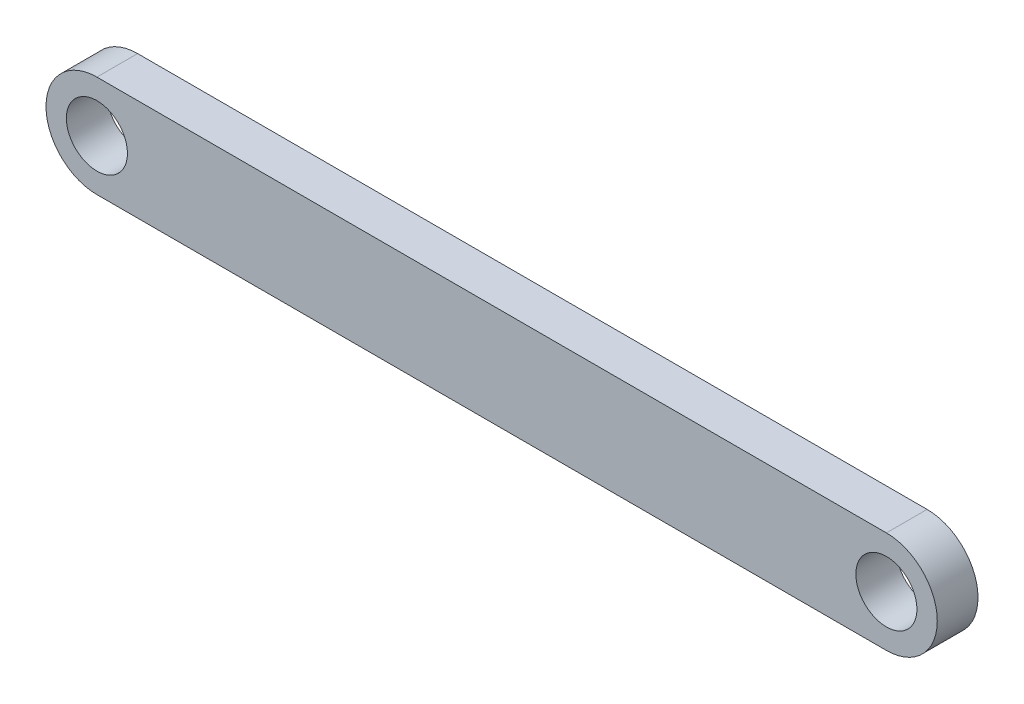
ISO-10303-21;
HEADER;
FILE_DESCRIPTION(('STEP AP214'),'2;1');
FILE_NAME('part.step','',(''),(''),'','','');
FILE_SCHEMA(('AUTOMOTIVE_DESIGN { 1 0 10303 214 1 1 1 1 }'));
ENDSEC;
DATA;
#1=APPLICATION_CONTEXT('core data for automotive mechanical design processes');
#2=APPLICATION_PROTOCOL_DEFINITION('international standard','automotive_design',2000,#1);
#3=PRODUCT_CONTEXT('',#1,'mechanical');
#4=PRODUCT('Part','Part','',(#3));
#5=PRODUCT_RELATED_PRODUCT_CATEGORY('part','',(#4));
#6=PRODUCT_DEFINITION_FORMATION('','',#4);
#7=PRODUCT_DEFINITION_CONTEXT('part definition',#1,'design');
#8=PRODUCT_DEFINITION('design','',#6,#7);
#9=PRODUCT_DEFINITION_SHAPE('','',#8);
#10=(LENGTH_UNIT() NAMED_UNIT(*) SI_UNIT(.MILLI.,.METRE.));
#11=(NAMED_UNIT(*) PLANE_ANGLE_UNIT() SI_UNIT($,.RADIAN.));
#12=(NAMED_UNIT(*) SI_UNIT($,.STERADIAN.) SOLID_ANGLE_UNIT());
#13=UNCERTAINTY_MEASURE_WITH_UNIT(LENGTH_MEASURE(1.E-05),#10,'distance_accuracy_value','');
#14=(GEOMETRIC_REPRESENTATION_CONTEXT(3) GLOBAL_UNCERTAINTY_ASSIGNED_CONTEXT((#13)) GLOBAL_UNIT_ASSIGNED_CONTEXT((#10,
#11,#12)) REPRESENTATION_CONTEXT('',''));
#15=CARTESIAN_POINT('',(0.,0.,0.));
#16=DIRECTION('',(0.,0.,1.));
#17=DIRECTION('',(1.,0.,0.));
#18=AXIS2_PLACEMENT_3D('',#15,#16,#17);
#19=CARTESIAN_POINT('',(0.0870778426490151,0.00226771058156779,2.));
#20=DIRECTION('',(0.,0.,1.));
#21=DIRECTION('',(1.,0.,0.));
#22=AXIS2_PLACEMENT_3D('',#19,#20,#21);
#23=PLANE('',#22);
#24=CARTESIAN_POINT('',(0.0870778426490151,0.00226771058156779,2.));
#25=DIRECTION('',(0.,0.,1.));
#26=DIRECTION('',(1.,0.,0.));
#27=AXIS2_PLACEMENT_3D('',#24,#25,#26);
#28=CIRCLE('',#27,1.5);
#29=CARTESIAN_POINT('',(1.58707784264902,0.00226771058156779,2.));
#30=VERTEX_POINT('',#29);
#31=EDGE_CURVE('E101',#30,#30,#28,.T.);
#32=ORIENTED_EDGE('',*,*,#31,.F.);
#33=EDGE_LOOP('',(#32));
#34=FACE_BOUND('',#33,.T.);
#35=CARTESIAN_POINT('',(0.0870778426490151,0.00226771058156779,2.));
#36=DIRECTION('',(0.,0.,1.));
#37=DIRECTION('',(1.,0.,0.));
#38=AXIS2_PLACEMENT_3D('',#35,#36,#37);
#39=CIRCLE('',#38,2.5);
#40=CARTESIAN_POINT('',(0.0870778426490151,2.50226771058157,2.));
#41=VERTEX_POINT('',#40);
#42=CARTESIAN_POINT('',(0.0870778426490151,-2.49773228941843,2.));
#43=VERTEX_POINT('',#42);
#44=EDGE_CURVE('E86',#41,#43,#39,.T.);
#45=ORIENTED_EDGE('',*,*,#44,.T.);
#46=DIRECTION('',(1.,0.,0.));
#47=VECTOR('',#46,1.);
#48=CARTESIAN_POINT('',(0.0870778426490151,-2.49773228941843,2.));
#49=LINE('',#48,#47);
#50=CARTESIAN_POINT('',(38.867077842649,-2.49773228941843,2.));
#51=VERTEX_POINT('',#50);
#52=EDGE_CURVE('E81',#43,#51,#49,.T.);
#53=ORIENTED_EDGE('',*,*,#52,.T.);
#54=CARTESIAN_POINT('',(38.867077842649,0.00226771058156779,2.));
#55=DIRECTION('',(0.,0.,1.));
#56=DIRECTION('',(1.,0.,0.));
#57=AXIS2_PLACEMENT_3D('',#54,#55,#56);
#58=CIRCLE('',#57,2.5);
#59=CARTESIAN_POINT('',(38.867077842649,2.50226771058157,2.));
#60=VERTEX_POINT('',#59);
#61=EDGE_CURVE('E84',#51,#60,#58,.T.);
#62=ORIENTED_EDGE('',*,*,#61,.T.);
#63=DIRECTION('',(-1.,0.,0.));
#64=VECTOR('',#63,1.);
#65=CARTESIAN_POINT('',(0.0870778426490151,2.50226771058157,2.));
#66=LINE('',#65,#64);
#67=EDGE_CURVE('E51',#60,#41,#66,.T.);
#68=ORIENTED_EDGE('',*,*,#67,.T.);
#69=EDGE_LOOP('',(#45,#53,#62,#68));
#70=FACE_BOUND('',#69,.T.);
#71=CARTESIAN_POINT('',(38.867077842649,0.00226771058156779,2.));
#72=DIRECTION('',(0.,0.,1.));
#73=DIRECTION('',(1.,0.,0.));
#74=AXIS2_PLACEMENT_3D('',#71,#72,#73);
#75=CIRCLE('',#74,1.5);
#76=CARTESIAN_POINT('',(40.367077842649,0.00226771058156779,2.));
#77=VERTEX_POINT('',#76);
#78=EDGE_CURVE('E116',#77,#77,#75,.T.);
#79=ORIENTED_EDGE('',*,*,#78,.F.);
#80=EDGE_LOOP('',(#79));
#81=FACE_BOUND('',#80,.T.);
#82=ADVANCED_FACE('F34',(#34,#70,#81),#23,.T.);
#83=CARTESIAN_POINT('',(0.0870778426490151,0.00226771058156779,0.));
#84=DIRECTION('',(0.,0.,1.));
#85=DIRECTION('',(1.,0.,0.));
#86=AXIS2_PLACEMENT_3D('',#83,#84,#85);
#87=PLANE('',#86);
#88=CARTESIAN_POINT('',(0.0870778426490151,0.00226771058156779,0.));
#89=DIRECTION('',(0.,0.,1.));
#90=DIRECTION('',(1.,0.,0.));
#91=AXIS2_PLACEMENT_3D('',#88,#89,#90);
#92=CIRCLE('',#91,2.5);
#93=CARTESIAN_POINT('',(0.0870778426490151,2.50226771058157,0.));
#94=VERTEX_POINT('',#93);
#95=CARTESIAN_POINT('',(0.0870778426490151,-2.49773228941843,0.));
#96=VERTEX_POINT('',#95);
#97=EDGE_CURVE('E98',#94,#96,#92,.T.);
#98=ORIENTED_EDGE('',*,*,#97,.F.);
#99=DIRECTION('',(-1.,0.,0.));
#100=VECTOR('',#99,1.);
#101=CARTESIAN_POINT('',(0.0870778426490151,2.50226771058157,0.));
#102=LINE('',#101,#100);
#103=CARTESIAN_POINT('',(38.867077842649,2.50226771058157,0.));
#104=VERTEX_POINT('',#103);
#105=EDGE_CURVE('E74',#104,#94,#102,.T.);
#106=ORIENTED_EDGE('',*,*,#105,.F.);
#107=CARTESIAN_POINT('',(38.867077842649,0.00226771058156779,0.));
#108=DIRECTION('',(0.,0.,1.));
#109=DIRECTION('',(1.,0.,0.));
#110=AXIS2_PLACEMENT_3D('',#107,#108,#109);
#111=CIRCLE('',#110,2.5);
#112=CARTESIAN_POINT('',(38.867077842649,-2.49773228941843,0.));
#113=VERTEX_POINT('',#112);
#114=EDGE_CURVE('E68',#113,#104,#111,.T.);
#115=ORIENTED_EDGE('',*,*,#114,.F.);
#116=DIRECTION('',(1.,0.,0.));
#117=VECTOR('',#116,1.);
#118=CARTESIAN_POINT('',(0.0870778426490151,-2.49773228941843,0.));
#119=LINE('',#118,#117);
#120=EDGE_CURVE('E90',#96,#113,#119,.T.);
#121=ORIENTED_EDGE('',*,*,#120,.F.);
#122=EDGE_LOOP('',(#98,#106,#115,#121));
#123=FACE_BOUND('',#122,.T.);
#124=CARTESIAN_POINT('',(0.0870778426490151,0.00226771058156779,0.));
#125=DIRECTION('',(0.,0.,1.));
#126=DIRECTION('',(1.,0.,0.));
#127=AXIS2_PLACEMENT_3D('',#124,#125,#126);
#128=CIRCLE('',#127,1.5);
#129=CARTESIAN_POINT('',(1.58707784264902,0.00226771058156779,0.));
#130=VERTEX_POINT('',#129);
#131=EDGE_CURVE('E113',#130,#130,#128,.T.);
#132=ORIENTED_EDGE('',*,*,#131,.T.);
#133=EDGE_LOOP('',(#132));
#134=FACE_BOUND('',#133,.T.);
#135=CARTESIAN_POINT('',(38.867077842649,0.00226771058156779,0.));
#136=DIRECTION('',(0.,0.,1.));
#137=DIRECTION('',(1.,0.,0.));
#138=AXIS2_PLACEMENT_3D('',#135,#136,#137);
#139=CIRCLE('',#138,1.5);
#140=CARTESIAN_POINT('',(40.367077842649,0.00226771058156779,0.));
#141=VERTEX_POINT('',#140);
#142=EDGE_CURVE('E119',#141,#141,#139,.T.);
#143=ORIENTED_EDGE('',*,*,#142,.T.);
#144=EDGE_LOOP('',(#143));
#145=FACE_BOUND('',#144,.T.);
#146=ADVANCED_FACE('F109',(#123,#134,#145),#87,.F.);
#147=CARTESIAN_POINT('',(0.0870778426490151,0.00226771058156779,2.));
#148=DIRECTION('',(0.,0.,-1.));
#149=DIRECTION('',(-1.,0.,0.));
#150=AXIS2_PLACEMENT_3D('',#147,#148,#149);
#151=CYLINDRICAL_SURFACE('',#150,2.5);
#152=ORIENTED_EDGE('',*,*,#97,.T.);
#153=DIRECTION('',(0.,0.,-1.));
#154=VECTOR('',#153,1.);
#155=CARTESIAN_POINT('',(0.0870778426490151,-2.49773228941843,2.));
#156=LINE('',#155,#154);
#157=EDGE_CURVE('E11',#43,#96,#156,.T.);
#158=ORIENTED_EDGE('',*,*,#157,.F.);
#159=ORIENTED_EDGE('',*,*,#44,.F.);
#160=DIRECTION('',(0.,0.,-1.));
#161=VECTOR('',#160,1.);
#162=CARTESIAN_POINT('',(0.0870778426490151,2.50226771058157,2.));
#163=LINE('',#162,#161);
#164=EDGE_CURVE('E94',#41,#94,#163,.T.);
#165=ORIENTED_EDGE('',*,*,#164,.T.);
#166=EDGE_LOOP('',(#152,#158,#159,#165));
#167=FACE_BOUND('',#166,.T.);
#168=ADVANCED_FACE('F36',(#167),#151,.T.);
#169=CARTESIAN_POINT('',(0.0870778426490151,-2.49773228941843,2.));
#170=DIRECTION('',(0.,1.,0.));
#171=DIRECTION('',(0.,0.,1.));
#172=AXIS2_PLACEMENT_3D('',#169,#170,#171);
#173=PLANE('',#172);
#174=ORIENTED_EDGE('',*,*,#120,.T.);
#175=DIRECTION('',(0.,0.,-1.));
#176=VECTOR('',#175,1.);
#177=CARTESIAN_POINT('',(38.867077842649,-2.49773228941843,2.));
#178=LINE('',#177,#176);
#179=EDGE_CURVE('E43',#51,#113,#178,.T.);
#180=ORIENTED_EDGE('',*,*,#179,.F.);
#181=ORIENTED_EDGE('',*,*,#52,.F.);
#182=ORIENTED_EDGE('',*,*,#157,.T.);
#183=EDGE_LOOP('',(#174,#180,#181,#182));
#184=FACE_BOUND('',#183,.T.);
#185=ADVANCED_FACE('F89',(#184),#173,.F.);
#186=CARTESIAN_POINT('',(38.867077842649,0.00226771058156779,2.));
#187=DIRECTION('',(0.,0.,-1.));
#188=DIRECTION('',(-1.,0.,0.));
#189=AXIS2_PLACEMENT_3D('',#186,#187,#188);
#190=CYLINDRICAL_SURFACE('',#189,2.5);
#191=ORIENTED_EDGE('',*,*,#114,.T.);
#192=DIRECTION('',(0.,0.,-1.));
#193=VECTOR('',#192,1.);
#194=CARTESIAN_POINT('',(38.867077842649,2.50226771058157,2.));
#195=LINE('',#194,#193);
#196=EDGE_CURVE('E91',#60,#104,#195,.T.);
#197=ORIENTED_EDGE('',*,*,#196,.F.);
#198=ORIENTED_EDGE('',*,*,#61,.F.);
#199=ORIENTED_EDGE('',*,*,#179,.T.);
#200=EDGE_LOOP('',(#191,#197,#198,#199));
#201=FACE_BOUND('',#200,.T.);
#202=ADVANCED_FACE('F92',(#201),#190,.T.);
#203=CARTESIAN_POINT('',(0.0870778426490151,2.50226771058157,2.));
#204=DIRECTION('',(0.,-1.,0.));
#205=DIRECTION('',(0.,0.,-1.));
#206=AXIS2_PLACEMENT_3D('',#203,#204,#205);
#207=PLANE('',#206);
#208=ORIENTED_EDGE('',*,*,#105,.T.);
#209=ORIENTED_EDGE('',*,*,#164,.F.);
#210=ORIENTED_EDGE('',*,*,#67,.F.);
#211=ORIENTED_EDGE('',*,*,#196,.T.);
#212=EDGE_LOOP('',(#208,#209,#210,#211));
#213=FACE_BOUND('',#212,.T.);
#214=ADVANCED_FACE('F106',(#213),#207,.F.);
#215=CARTESIAN_POINT('',(0.0870778426490151,0.00226771058156779,2.));
#216=DIRECTION('',(0.,0.,-1.));
#217=DIRECTION('',(-1.,0.,0.));
#218=AXIS2_PLACEMENT_3D('',#215,#216,#217);
#219=CYLINDRICAL_SURFACE('',#218,1.5);
#220=ORIENTED_EDGE('',*,*,#31,.T.);
#221=EDGE_LOOP('',(#220));
#222=FACE_BOUND('',#221,.T.);
#223=ORIENTED_EDGE('',*,*,#131,.F.);
#224=EDGE_LOOP('',(#223));
#225=FACE_BOUND('',#224,.T.);
#226=ADVANCED_FACE('F136',(#222,#225),#219,.F.);
#227=CARTESIAN_POINT('',(38.867077842649,0.00226771058156779,2.));
#228=DIRECTION('',(0.,0.,-1.));
#229=DIRECTION('',(-1.,0.,0.));
#230=AXIS2_PLACEMENT_3D('',#227,#228,#229);
#231=CYLINDRICAL_SURFACE('',#230,1.5);
#232=ORIENTED_EDGE('',*,*,#78,.T.);
#233=EDGE_LOOP('',(#232));
#234=FACE_BOUND('',#233,.T.);
#235=ORIENTED_EDGE('',*,*,#142,.F.);
#236=EDGE_LOOP('',(#235));
#237=FACE_BOUND('',#236,.T.);
#238=ADVANCED_FACE('F125',(#234,#237),#231,.F.);
#239=CLOSED_SHELL('',(#82,#146,#168,#185,#202,#214,#226,#238));
#240=MANIFOLD_SOLID_BREP('B2',#239);
#241=ADVANCED_BREP_SHAPE_REPRESENTATION('',(#18,#240),#14);
#242=SHAPE_DEFINITION_REPRESENTATION(#9,#241);
ENDSEC;
END-ISO-10303-21;
